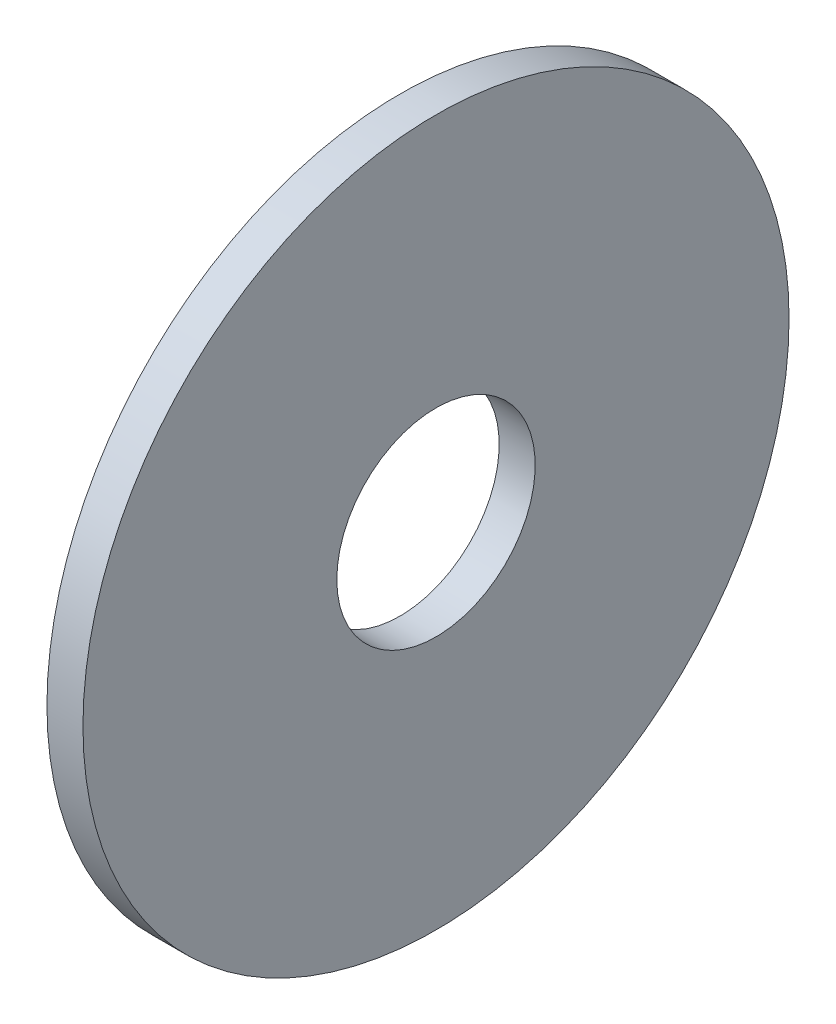
ISO-10303-21;
HEADER;
FILE_DESCRIPTION(('STEP AP214'),'2;1');
FILE_NAME('part.step','',(''),(''),'','','');
FILE_SCHEMA(('AUTOMOTIVE_DESIGN { 1 0 10303 214 1 1 1 1 }'));
ENDSEC;
DATA;
#1=APPLICATION_CONTEXT('core data for automotive mechanical design processes');
#2=APPLICATION_PROTOCOL_DEFINITION('international standard','automotive_design',2000,#1);
#3=PRODUCT_CONTEXT('',#1,'mechanical');
#4=PRODUCT('Part','Part','',(#3));
#5=PRODUCT_RELATED_PRODUCT_CATEGORY('part','',(#4));
#6=PRODUCT_DEFINITION_FORMATION('','',#4);
#7=PRODUCT_DEFINITION_CONTEXT('part definition',#1,'design');
#8=PRODUCT_DEFINITION('design','',#6,#7);
#9=PRODUCT_DEFINITION_SHAPE('','',#8);
#10=(LENGTH_UNIT() NAMED_UNIT(*) SI_UNIT(.MILLI.,.METRE.));
#11=(NAMED_UNIT(*) PLANE_ANGLE_UNIT() SI_UNIT($,.RADIAN.));
#12=(NAMED_UNIT(*) SI_UNIT($,.STERADIAN.) SOLID_ANGLE_UNIT());
#13=UNCERTAINTY_MEASURE_WITH_UNIT(LENGTH_MEASURE(1.E-05),#10,'distance_accuracy_value','');
#14=(GEOMETRIC_REPRESENTATION_CONTEXT(3) GLOBAL_UNCERTAINTY_ASSIGNED_CONTEXT((#13)) GLOBAL_UNIT_ASSIGNED_CONTEXT((#10,
#11,#12)) REPRESENTATION_CONTEXT('',''));
#15=CARTESIAN_POINT('',(0.,0.,0.));
#16=DIRECTION('',(0.,0.,1.));
#17=DIRECTION('',(1.,0.,0.));
#18=AXIS2_PLACEMENT_3D('',#15,#16,#17);
#19=CARTESIAN_POINT('',(0.,0.,0.));
#20=DIRECTION('',(1.,0.,0.));
#21=DIRECTION('',(0.,0.,-1.));
#22=AXIS2_PLACEMENT_3D('',#19,#20,#21);
#23=PLANE('',#22);
#24=CARTESIAN_POINT('',(0.,0.,0.));
#25=DIRECTION('',(-1.,0.,0.));
#26=DIRECTION('',(0.,0.,1.));
#27=AXIS2_PLACEMENT_3D('',#24,#25,#26);
#28=CIRCLE('',#27,3.5687);
#29=CARTESIAN_POINT('',(0.,0.,3.5687));
#30=VERTEX_POINT('',#29);
#31=EDGE_CURVE('E26',#30,#30,#28,.F.);
#32=ORIENTED_EDGE('',*,*,#31,.T.);
#33=EDGE_LOOP('',(#32));
#34=FACE_BOUND('',#33,.T.);
#35=CARTESIAN_POINT('',(0.,0.,0.));
#36=DIRECTION('',(-1.,0.,0.));
#37=DIRECTION('',(0.,0.,1.));
#38=AXIS2_PLACEMENT_3D('',#35,#36,#37);
#39=CIRCLE('',#38,12.7);
#40=CARTESIAN_POINT('',(0.,0.,12.7));
#41=VERTEX_POINT('',#40);
#42=EDGE_CURVE('E17',#41,#41,#39,.F.);
#43=ORIENTED_EDGE('',*,*,#42,.F.);
#44=EDGE_LOOP('',(#43));
#45=FACE_BOUND('',#44,.T.);
#46=ADVANCED_FACE('F14',(#34,#45),#23,.F.);
#47=CARTESIAN_POINT('',(1.2954,0.,0.));
#48=DIRECTION('',(-1.,0.,0.));
#49=DIRECTION('',(0.,0.,1.));
#50=AXIS2_PLACEMENT_3D('',#47,#48,#49);
#51=CYLINDRICAL_SURFACE('',#50,12.7);
#52=ORIENTED_EDGE('',*,*,#42,.T.);
#53=EDGE_LOOP('',(#52));
#54=FACE_BOUND('',#53,.T.);
#55=CARTESIAN_POINT('',(1.2954,0.,0.));
#56=DIRECTION('',(-1.,0.,0.));
#57=DIRECTION('',(0.,0.,1.));
#58=AXIS2_PLACEMENT_3D('',#55,#56,#57);
#59=CIRCLE('',#58,12.7);
#60=CARTESIAN_POINT('',(1.2954,0.,12.7));
#61=VERTEX_POINT('',#60);
#62=EDGE_CURVE('E21',#61,#61,#59,.F.);
#63=ORIENTED_EDGE('',*,*,#62,.F.);
#64=EDGE_LOOP('',(#63));
#65=FACE_BOUND('',#64,.T.);
#66=ADVANCED_FACE('F34',(#54,#65),#51,.T.);
#67=CARTESIAN_POINT('',(1.2954,0.,0.));
#68=DIRECTION('',(-1.,0.,0.));
#69=DIRECTION('',(0.,0.,1.));
#70=AXIS2_PLACEMENT_3D('',#67,#68,#69);
#71=CYLINDRICAL_SURFACE('',#70,3.5687);
#72=CARTESIAN_POINT('',(1.2954,0.,0.));
#73=DIRECTION('',(-1.,0.,0.));
#74=DIRECTION('',(0.,0.,1.));
#75=AXIS2_PLACEMENT_3D('',#72,#73,#74);
#76=CIRCLE('',#75,3.5687);
#77=CARTESIAN_POINT('',(1.2954,0.,3.5687));
#78=VERTEX_POINT('',#77);
#79=EDGE_CURVE('E10',#78,#78,#76,.T.);
#80=ORIENTED_EDGE('',*,*,#79,.F.);
#81=EDGE_LOOP('',(#80));
#82=FACE_BOUND('',#81,.T.);
#83=ORIENTED_EDGE('',*,*,#31,.F.);
#84=EDGE_LOOP('',(#83));
#85=FACE_BOUND('',#84,.T.);
#86=ADVANCED_FACE('F42',(#82,#85),#71,.F.);
#87=CARTESIAN_POINT('',(1.2954,0.,0.));
#88=DIRECTION('',(1.,0.,0.));
#89=DIRECTION('',(0.,0.,-1.));
#90=AXIS2_PLACEMENT_3D('',#87,#88,#89);
#91=PLANE('',#90);
#92=ORIENTED_EDGE('',*,*,#79,.T.);
#93=EDGE_LOOP('',(#92));
#94=FACE_BOUND('',#93,.T.);
#95=ORIENTED_EDGE('',*,*,#62,.T.);
#96=EDGE_LOOP('',(#95));
#97=FACE_BOUND('',#96,.T.);
#98=ADVANCED_FACE('F43',(#94,#97),#91,.T.);
#99=CLOSED_SHELL('',(#46,#66,#86,#98));
#100=MANIFOLD_SOLID_BREP('B1',#99);
#101=ADVANCED_BREP_SHAPE_REPRESENTATION('',(#18,#100),#14);
#102=SHAPE_DEFINITION_REPRESENTATION(#9,#101);
ENDSEC;
END-ISO-10303-21;
